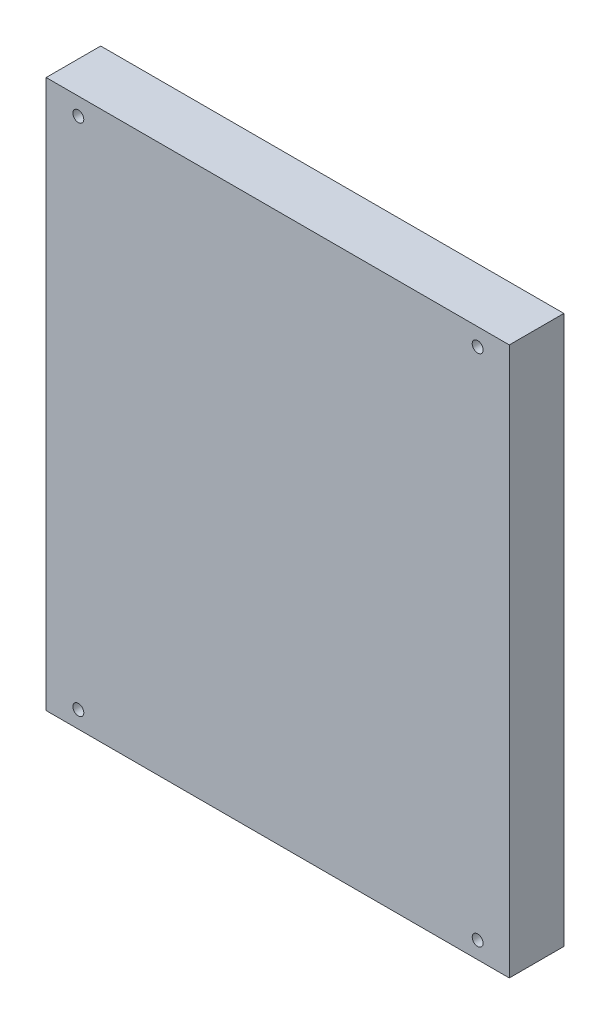
ISO-10303-21;
HEADER;
FILE_DESCRIPTION(('STEP AP214'),'2;1');
FILE_NAME('part.step','',(''),(''),'','','');
FILE_SCHEMA(('AUTOMOTIVE_DESIGN { 1 0 10303 214 1 1 1 1 }'));
ENDSEC;
DATA;
#1=APPLICATION_CONTEXT('core data for automotive mechanical design processes');
#2=APPLICATION_PROTOCOL_DEFINITION('international standard','automotive_design',2000,#1);
#3=PRODUCT_CONTEXT('',#1,'mechanical');
#4=PRODUCT('Part','Part','',(#3));
#5=PRODUCT_RELATED_PRODUCT_CATEGORY('part','',(#4));
#6=PRODUCT_DEFINITION_FORMATION('','',#4);
#7=PRODUCT_DEFINITION_CONTEXT('part definition',#1,'design');
#8=PRODUCT_DEFINITION('design','',#6,#7);
#9=PRODUCT_DEFINITION_SHAPE('','',#8);
#10=(LENGTH_UNIT() NAMED_UNIT(*) SI_UNIT(.MILLI.,.METRE.));
#11=(NAMED_UNIT(*) PLANE_ANGLE_UNIT() SI_UNIT($,.RADIAN.));
#12=(NAMED_UNIT(*) SI_UNIT($,.STERADIAN.) SOLID_ANGLE_UNIT());
#13=UNCERTAINTY_MEASURE_WITH_UNIT(LENGTH_MEASURE(1.E-05),#10,'distance_accuracy_value','');
#14=(GEOMETRIC_REPRESENTATION_CONTEXT(3) GLOBAL_UNCERTAINTY_ASSIGNED_CONTEXT((#13)) GLOBAL_UNIT_ASSIGNED_CONTEXT((#10,
#11,#12)) REPRESENTATION_CONTEXT('',''));
#15=CARTESIAN_POINT('',(0.,0.,0.));
#16=DIRECTION('',(0.,0.,1.));
#17=DIRECTION('',(1.,0.,0.));
#18=AXIS2_PLACEMENT_3D('',#15,#16,#17);
#19=CARTESIAN_POINT('',(0.,0.,10.));
#20=DIRECTION('',(1.,0.,0.));
#21=DIRECTION('',(0.,1.,0.));
#22=AXIS2_PLACEMENT_3D('',#19,#20,#21);
#23=PLANE('',#22);
#24=DIRECTION('',(0.,-1.,0.));
#25=VECTOR('',#24,1.);
#26=CARTESIAN_POINT('',(0.,0.,0.));
#27=LINE('',#26,#25);
#28=CARTESIAN_POINT('',(0.,100.5,0.));
#29=VERTEX_POINT('',#28);
#30=CARTESIAN_POINT('',(0.,0.,0.));
#31=VERTEX_POINT('',#30);
#32=EDGE_CURVE('E96',#29,#31,#27,.T.);
#33=ORIENTED_EDGE('',*,*,#32,.T.);
#34=DIRECTION('',(0.,0.,-1.));
#35=VECTOR('',#34,1.);
#36=CARTESIAN_POINT('',(0.,0.,10.));
#37=LINE('',#36,#35);
#38=CARTESIAN_POINT('',(0.,0.,10.));
#39=VERTEX_POINT('',#38);
#40=EDGE_CURVE('E11',#39,#31,#37,.T.);
#41=ORIENTED_EDGE('',*,*,#40,.F.);
#42=DIRECTION('',(0.,-1.,0.));
#43=VECTOR('',#42,1.);
#44=CARTESIAN_POINT('',(0.,0.,10.));
#45=LINE('',#44,#43);
#46=CARTESIAN_POINT('',(0.,100.5,10.));
#47=VERTEX_POINT('',#46);
#48=EDGE_CURVE('E84',#47,#39,#45,.T.);
#49=ORIENTED_EDGE('',*,*,#48,.F.);
#50=DIRECTION('',(0.,0.,-1.));
#51=VECTOR('',#50,1.);
#52=CARTESIAN_POINT('',(0.,100.5,10.));
#53=LINE('',#52,#51);
#54=EDGE_CURVE('E92',#47,#29,#53,.T.);
#55=ORIENTED_EDGE('',*,*,#54,.T.);
#56=EDGE_LOOP('',(#33,#41,#49,#55));
#57=FACE_BOUND('',#56,.T.);
#58=ADVANCED_FACE('F33',(#57),#23,.F.);
#59=CARTESIAN_POINT('',(0.,0.,10.));
#60=DIRECTION('',(0.,1.,0.));
#61=DIRECTION('',(0.,0.,1.));
#62=AXIS2_PLACEMENT_3D('',#59,#60,#61);
#63=PLANE('',#62);
#64=DIRECTION('',(1.,0.,0.));
#65=VECTOR('',#64,1.);
#66=CARTESIAN_POINT('',(0.,0.,0.));
#67=LINE('',#66,#65);
#68=CARTESIAN_POINT('',(84.9,0.,0.));
#69=VERTEX_POINT('',#68);
#70=EDGE_CURVE('E88',#31,#69,#67,.T.);
#71=ORIENTED_EDGE('',*,*,#70,.T.);
#72=DIRECTION('',(0.,0.,-1.));
#73=VECTOR('',#72,1.);
#74=CARTESIAN_POINT('',(84.9,0.,10.));
#75=LINE('',#74,#73);
#76=CARTESIAN_POINT('',(84.9,0.,10.));
#77=VERTEX_POINT('',#76);
#78=EDGE_CURVE('E41',#77,#69,#75,.T.);
#79=ORIENTED_EDGE('',*,*,#78,.F.);
#80=DIRECTION('',(1.,0.,0.));
#81=VECTOR('',#80,1.);
#82=CARTESIAN_POINT('',(0.,0.,10.));
#83=LINE('',#82,#81);
#84=EDGE_CURVE('E79',#39,#77,#83,.T.);
#85=ORIENTED_EDGE('',*,*,#84,.F.);
#86=ORIENTED_EDGE('',*,*,#40,.T.);
#87=EDGE_LOOP('',(#71,#79,#85,#86));
#88=FACE_BOUND('',#87,.T.);
#89=ADVANCED_FACE('F87',(#88),#63,.F.);
#90=CARTESIAN_POINT('',(84.9,0.,10.));
#91=DIRECTION('',(-1.,0.,0.));
#92=DIRECTION('',(0.,0.,1.));
#93=AXIS2_PLACEMENT_3D('',#90,#91,#92);
#94=PLANE('',#93);
#95=DIRECTION('',(0.,1.,0.));
#96=VECTOR('',#95,1.);
#97=CARTESIAN_POINT('',(84.9,0.,0.));
#98=LINE('',#97,#96);
#99=CARTESIAN_POINT('',(84.9,100.5,0.));
#100=VERTEX_POINT('',#99);
#101=EDGE_CURVE('E66',#69,#100,#98,.T.);
#102=ORIENTED_EDGE('',*,*,#101,.T.);
#103=DIRECTION('',(0.,0.,-1.));
#104=VECTOR('',#103,1.);
#105=CARTESIAN_POINT('',(84.9,100.5,10.));
#106=LINE('',#105,#104);
#107=CARTESIAN_POINT('',(84.9,100.5,10.));
#108=VERTEX_POINT('',#107);
#109=EDGE_CURVE('E89',#108,#100,#106,.T.);
#110=ORIENTED_EDGE('',*,*,#109,.F.);
#111=DIRECTION('',(0.,1.,0.));
#112=VECTOR('',#111,1.);
#113=CARTESIAN_POINT('',(84.9,0.,10.));
#114=LINE('',#113,#112);
#115=EDGE_CURVE('E82',#77,#108,#114,.T.);
#116=ORIENTED_EDGE('',*,*,#115,.F.);
#117=ORIENTED_EDGE('',*,*,#78,.T.);
#118=EDGE_LOOP('',(#102,#110,#116,#117));
#119=FACE_BOUND('',#118,.T.);
#120=ADVANCED_FACE('F90',(#119),#94,.F.);
#121=CARTESIAN_POINT('',(0.,100.5,10.));
#122=DIRECTION('',(0.,-1.,0.));
#123=DIRECTION('',(0.,0.,-1.));
#124=AXIS2_PLACEMENT_3D('',#121,#122,#123);
#125=PLANE('',#124);
#126=DIRECTION('',(-1.,0.,0.));
#127=VECTOR('',#126,1.);
#128=CARTESIAN_POINT('',(0.,100.5,0.));
#129=LINE('',#128,#127);
#130=EDGE_CURVE('E72',#100,#29,#129,.T.);
#131=ORIENTED_EDGE('',*,*,#130,.T.);
#132=ORIENTED_EDGE('',*,*,#54,.F.);
#133=DIRECTION('',(-1.,0.,0.));
#134=VECTOR('',#133,1.);
#135=CARTESIAN_POINT('',(0.,100.5,10.));
#136=LINE('',#135,#134);
#137=EDGE_CURVE('E49',#108,#47,#136,.T.);
#138=ORIENTED_EDGE('',*,*,#137,.F.);
#139=ORIENTED_EDGE('',*,*,#109,.T.);
#140=EDGE_LOOP('',(#131,#132,#138,#139));
#141=FACE_BOUND('',#140,.T.);
#142=ADVANCED_FACE('F104',(#141),#125,.F.);
#143=CARTESIAN_POINT('',(0.,0.,10.));
#144=DIRECTION('',(0.,0.,-1.));
#145=DIRECTION('',(-1.,0.,0.));
#146=AXIS2_PLACEMENT_3D('',#143,#144,#145);
#147=PLANE('',#146);
#148=CARTESIAN_POINT('',(79.100000000001,3.10000000000001,10.));
#149=DIRECTION('',(0.,0.,1.));
#150=DIRECTION('',(1.,0.,0.));
#151=AXIS2_PLACEMENT_3D('',#148,#149,#150);
#152=CIRCLE('',#151,0.999999999999998);
#153=CARTESIAN_POINT('',(80.100000000001,3.10000000000001,10.));
#154=VERTEX_POINT('',#153);
#155=EDGE_CURVE('E128',#154,#154,#152,.T.);
#156=ORIENTED_EDGE('',*,*,#155,.F.);
#157=EDGE_LOOP('',(#156));
#158=FACE_BOUND('',#157,.T.);
#159=CARTESIAN_POINT('',(5.900000000001,3.09999999999949,10.));
#160=DIRECTION('',(0.,0.,1.));
#161=DIRECTION('',(1.,0.,0.));
#162=AXIS2_PLACEMENT_3D('',#159,#160,#161);
#163=CIRCLE('',#162,0.999999999999998);
#164=CARTESIAN_POINT('',(6.900000000001,3.09999999999949,10.));
#165=VERTEX_POINT('',#164);
#166=EDGE_CURVE('E122',#165,#165,#163,.T.);
#167=ORIENTED_EDGE('',*,*,#166,.F.);
#168=EDGE_LOOP('',(#167));
#169=FACE_BOUND('',#168,.T.);
#170=CARTESIAN_POINT('',(5.90000000000002,97.2999999999995,10.));
#171=DIRECTION('',(0.,0.,1.));
#172=DIRECTION('',(1.,0.,0.));
#173=AXIS2_PLACEMENT_3D('',#170,#171,#172);
#174=CIRCLE('',#173,0.999999999999998);
#175=CARTESIAN_POINT('',(6.90000000000001,97.2999999999995,10.));
#176=VERTEX_POINT('',#175);
#177=EDGE_CURVE('E116',#176,#176,#174,.T.);
#178=ORIENTED_EDGE('',*,*,#177,.F.);
#179=EDGE_LOOP('',(#178));
#180=FACE_BOUND('',#179,.T.);
#181=CARTESIAN_POINT('',(79.1,97.3,10.));
#182=DIRECTION('',(0.,0.,1.));
#183=DIRECTION('',(1.,0.,0.));
#184=AXIS2_PLACEMENT_3D('',#181,#182,#183);
#185=CIRCLE('',#184,0.999999999999998);
#186=CARTESIAN_POINT('',(80.1,97.3,10.));
#187=VERTEX_POINT('',#186);
#188=EDGE_CURVE('E110',#187,#187,#185,.T.);
#189=ORIENTED_EDGE('',*,*,#188,.F.);
#190=EDGE_LOOP('',(#189));
#191=FACE_BOUND('',#190,.T.);
#192=ORIENTED_EDGE('',*,*,#48,.T.);
#193=ORIENTED_EDGE('',*,*,#84,.T.);
#194=ORIENTED_EDGE('',*,*,#115,.T.);
#195=ORIENTED_EDGE('',*,*,#137,.T.);
#196=EDGE_LOOP('',(#192,#193,#194,#195));
#197=FACE_BOUND('',#196,.T.);
#198=ADVANCED_FACE('F80',(#158,#169,#180,#191,#197),#147,.F.);
#199=CARTESIAN_POINT('',(0.,0.,0.));
#200=DIRECTION('',(0.,0.,-1.));
#201=DIRECTION('',(-1.,0.,0.));
#202=AXIS2_PLACEMENT_3D('',#199,#200,#201);
#203=PLANE('',#202);
#204=CARTESIAN_POINT('',(79.100000000001,3.10000000000001,0.));
#205=DIRECTION('',(0.,0.,1.));
#206=DIRECTION('',(1.,0.,0.));
#207=AXIS2_PLACEMENT_3D('',#204,#205,#206);
#208=CIRCLE('',#207,0.999999999999998);
#209=CARTESIAN_POINT('',(80.100000000001,3.10000000000001,0.));
#210=VERTEX_POINT('',#209);
#211=EDGE_CURVE('E125',#210,#210,#208,.T.);
#212=ORIENTED_EDGE('',*,*,#211,.T.);
#213=EDGE_LOOP('',(#212));
#214=FACE_BOUND('',#213,.T.);
#215=CARTESIAN_POINT('',(5.900000000001,3.09999999999949,0.));
#216=DIRECTION('',(0.,0.,1.));
#217=DIRECTION('',(1.,0.,0.));
#218=AXIS2_PLACEMENT_3D('',#215,#216,#217);
#219=CIRCLE('',#218,0.999999999999998);
#220=CARTESIAN_POINT('',(6.900000000001,3.09999999999949,0.));
#221=VERTEX_POINT('',#220);
#222=EDGE_CURVE('E119',#221,#221,#219,.T.);
#223=ORIENTED_EDGE('',*,*,#222,.T.);
#224=EDGE_LOOP('',(#223));
#225=FACE_BOUND('',#224,.T.);
#226=CARTESIAN_POINT('',(5.90000000000002,97.2999999999995,0.));
#227=DIRECTION('',(0.,0.,1.));
#228=DIRECTION('',(1.,0.,0.));
#229=AXIS2_PLACEMENT_3D('',#226,#227,#228);
#230=CIRCLE('',#229,0.999999999999998);
#231=CARTESIAN_POINT('',(6.90000000000001,97.2999999999995,0.));
#232=VERTEX_POINT('',#231);
#233=EDGE_CURVE('E113',#232,#232,#230,.T.);
#234=ORIENTED_EDGE('',*,*,#233,.T.);
#235=EDGE_LOOP('',(#234));
#236=FACE_BOUND('',#235,.T.);
#237=CARTESIAN_POINT('',(79.1,97.3,0.));
#238=DIRECTION('',(0.,0.,1.));
#239=DIRECTION('',(1.,0.,0.));
#240=AXIS2_PLACEMENT_3D('',#237,#238,#239);
#241=CIRCLE('',#240,0.999999999999998);
#242=CARTESIAN_POINT('',(80.1,97.3,0.));
#243=VERTEX_POINT('',#242);
#244=EDGE_CURVE('E99',#243,#243,#241,.T.);
#245=ORIENTED_EDGE('',*,*,#244,.T.);
#246=EDGE_LOOP('',(#245));
#247=FACE_BOUND('',#246,.T.);
#248=ORIENTED_EDGE('',*,*,#32,.F.);
#249=ORIENTED_EDGE('',*,*,#130,.F.);
#250=ORIENTED_EDGE('',*,*,#101,.F.);
#251=ORIENTED_EDGE('',*,*,#70,.F.);
#252=EDGE_LOOP('',(#248,#249,#250,#251));
#253=FACE_BOUND('',#252,.T.);
#254=ADVANCED_FACE('F107',(#214,#225,#236,#247,#253),#203,.T.);
#255=CARTESIAN_POINT('',(79.1,97.3,0.));
#256=DIRECTION('',(0.,0.,1.));
#257=DIRECTION('',(1.,0.,0.));
#258=AXIS2_PLACEMENT_3D('',#255,#256,#257);
#259=CYLINDRICAL_SURFACE('',#258,0.999999999999998);
#260=ORIENTED_EDGE('',*,*,#244,.F.);
#261=EDGE_LOOP('',(#260));
#262=FACE_BOUND('',#261,.T.);
#263=ORIENTED_EDGE('',*,*,#188,.T.);
#264=EDGE_LOOP('',(#263));
#265=FACE_BOUND('',#264,.T.);
#266=ADVANCED_FACE('F152',(#262,#265),#259,.F.);
#267=CARTESIAN_POINT('',(5.90000000000002,97.2999999999995,0.));
#268=DIRECTION('',(0.,0.,1.));
#269=DIRECTION('',(1.,0.,0.));
#270=AXIS2_PLACEMENT_3D('',#267,#268,#269);
#271=CYLINDRICAL_SURFACE('',#270,0.999999999999998);
#272=ORIENTED_EDGE('',*,*,#233,.F.);
#273=EDGE_LOOP('',(#272));
#274=FACE_BOUND('',#273,.T.);
#275=ORIENTED_EDGE('',*,*,#177,.T.);
#276=EDGE_LOOP('',(#275));
#277=FACE_BOUND('',#276,.T.);
#278=ADVANCED_FACE('F154',(#274,#277),#271,.F.);
#279=CARTESIAN_POINT('',(5.900000000001,3.09999999999949,0.));
#280=DIRECTION('',(0.,0.,1.));
#281=DIRECTION('',(1.,0.,0.));
#282=AXIS2_PLACEMENT_3D('',#279,#280,#281);
#283=CYLINDRICAL_SURFACE('',#282,0.999999999999998);
#284=ORIENTED_EDGE('',*,*,#222,.F.);
#285=EDGE_LOOP('',(#284));
#286=FACE_BOUND('',#285,.T.);
#287=ORIENTED_EDGE('',*,*,#166,.T.);
#288=EDGE_LOOP('',(#287));
#289=FACE_BOUND('',#288,.T.);
#290=ADVANCED_FACE('F139',(#286,#289),#283,.F.);
#291=CARTESIAN_POINT('',(79.100000000001,3.10000000000001,0.));
#292=DIRECTION('',(0.,0.,1.));
#293=DIRECTION('',(1.,0.,0.));
#294=AXIS2_PLACEMENT_3D('',#291,#292,#293);
#295=CYLINDRICAL_SURFACE('',#294,0.999999999999998);
#296=ORIENTED_EDGE('',*,*,#211,.F.);
#297=EDGE_LOOP('',(#296));
#298=FACE_BOUND('',#297,.T.);
#299=ORIENTED_EDGE('',*,*,#155,.T.);
#300=EDGE_LOOP('',(#299));
#301=FACE_BOUND('',#300,.T.);
#302=ADVANCED_FACE('F136',(#298,#301),#295,.F.);
#303=CLOSED_SHELL('',(#58,#89,#120,#142,#198,#254,#266,#278,#290,#302));
#304=MANIFOLD_SOLID_BREP('B2',#303);
#305=ADVANCED_BREP_SHAPE_REPRESENTATION('',(#18,#304),#14);
#306=SHAPE_DEFINITION_REPRESENTATION(#9,#305);
ENDSEC;
END-ISO-10303-21;
